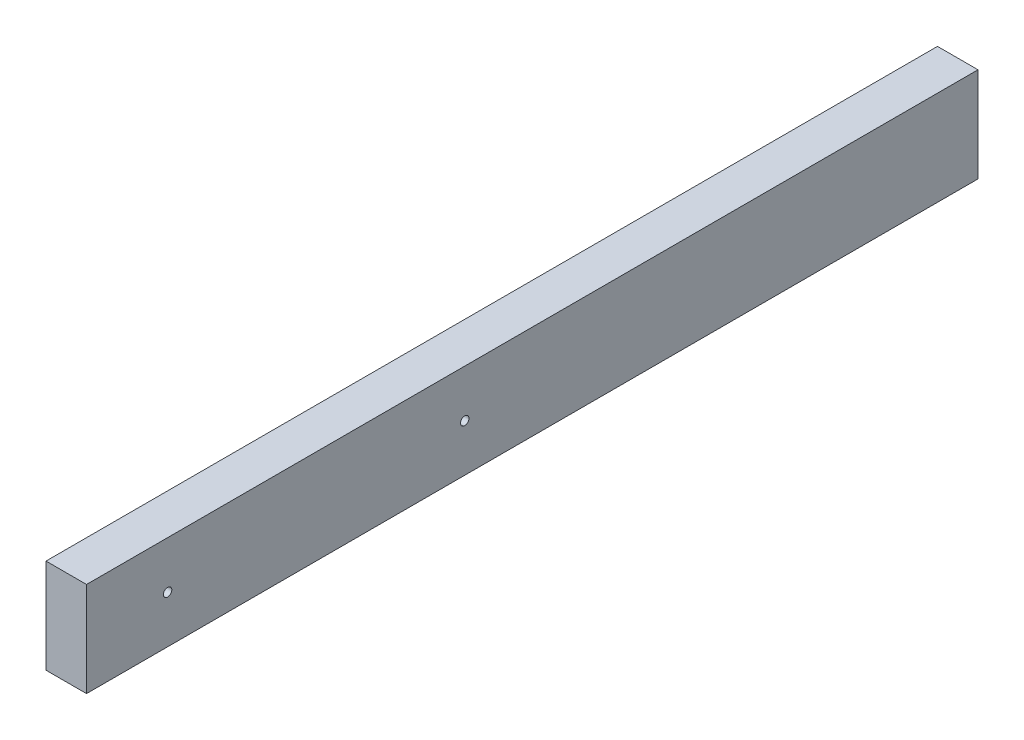
ISO-10303-21;
HEADER;
FILE_DESCRIPTION(('STEP AP214'),'2;1');
FILE_NAME('part.step','',(''),(''),'','','');
FILE_SCHEMA(('AUTOMOTIVE_DESIGN { 1 0 10303 214 1 1 1 1 }'));
ENDSEC;
DATA;
#1=APPLICATION_CONTEXT('core data for automotive mechanical design processes');
#2=APPLICATION_PROTOCOL_DEFINITION('international standard','automotive_design',2000,#1);
#3=PRODUCT_CONTEXT('',#1,'mechanical');
#4=PRODUCT('Part','Part','',(#3));
#5=PRODUCT_RELATED_PRODUCT_CATEGORY('part','',(#4));
#6=PRODUCT_DEFINITION_FORMATION('','',#4);
#7=PRODUCT_DEFINITION_CONTEXT('part definition',#1,'design');
#8=PRODUCT_DEFINITION('design','',#6,#7);
#9=PRODUCT_DEFINITION_SHAPE('','',#8);
#10=(LENGTH_UNIT() NAMED_UNIT(*) SI_UNIT(.MILLI.,.METRE.));
#11=(NAMED_UNIT(*) PLANE_ANGLE_UNIT() SI_UNIT($,.RADIAN.));
#12=(NAMED_UNIT(*) SI_UNIT($,.STERADIAN.) SOLID_ANGLE_UNIT());
#13=UNCERTAINTY_MEASURE_WITH_UNIT(LENGTH_MEASURE(1.E-05),#10,'distance_accuracy_value','');
#14=(GEOMETRIC_REPRESENTATION_CONTEXT(3) GLOBAL_UNCERTAINTY_ASSIGNED_CONTEXT((#13)) GLOBAL_UNIT_ASSIGNED_CONTEXT((#10,
#11,#12)) REPRESENTATION_CONTEXT('',''));
#15=CARTESIAN_POINT('',(0.,0.,0.));
#16=DIRECTION('',(0.,0.,1.));
#17=DIRECTION('',(1.,0.,0.));
#18=AXIS2_PLACEMENT_3D('',#15,#16,#17);
#19=CARTESIAN_POINT('',(19.05,-44.45,838.2));
#20=DIRECTION('',(-1.,0.,0.));
#21=DIRECTION('',(0.,0.,1.));
#22=AXIS2_PLACEMENT_3D('',#19,#20,#21);
#23=PLANE('',#22);
#24=CARTESIAN_POINT('',(19.05,0.,482.6));
#25=DIRECTION('',(1.,0.,0.));
#26=DIRECTION('',(0.,0.,-1.));
#27=AXIS2_PLACEMENT_3D('',#24,#25,#26);
#28=CIRCLE('',#27,3.96875);
#29=CARTESIAN_POINT('',(19.05,0.,478.63125));
#30=VERTEX_POINT('',#29);
#31=EDGE_CURVE('E139',#30,#30,#28,.T.);
#32=ORIENTED_EDGE('',*,*,#31,.F.);
#33=EDGE_LOOP('',(#32));
#34=FACE_BOUND('',#33,.T.);
#35=CARTESIAN_POINT('',(19.05,0.,762.));
#36=DIRECTION('',(1.,0.,0.));
#37=DIRECTION('',(0.,0.,-1.));
#38=AXIS2_PLACEMENT_3D('',#35,#36,#37);
#39=CIRCLE('',#38,3.96875);
#40=CARTESIAN_POINT('',(19.05,0.,758.03125));
#41=VERTEX_POINT('',#40);
#42=EDGE_CURVE('E131',#41,#41,#39,.T.);
#43=ORIENTED_EDGE('',*,*,#42,.F.);
#44=EDGE_LOOP('',(#43));
#45=FACE_BOUND('',#44,.T.);
#46=DIRECTION('',(0.,1.,0.));
#47=VECTOR('',#46,1.);
#48=CARTESIAN_POINT('',(19.05,-44.45,0.));
#49=LINE('',#48,#47);
#50=CARTESIAN_POINT('',(19.05,-44.45,0.));
#51=VERTEX_POINT('',#50);
#52=CARTESIAN_POINT('',(19.05,44.45,0.));
#53=VERTEX_POINT('',#52);
#54=EDGE_CURVE('E105',#51,#53,#49,.T.);
#55=ORIENTED_EDGE('',*,*,#54,.T.);
#56=DIRECTION('',(0.,0.,-1.));
#57=VECTOR('',#56,1.);
#58=CARTESIAN_POINT('',(19.05,44.45,838.2));
#59=LINE('',#58,#57);
#60=CARTESIAN_POINT('',(19.05,44.45,838.2));
#61=VERTEX_POINT('',#60);
#62=EDGE_CURVE('E11',#61,#53,#59,.T.);
#63=ORIENTED_EDGE('',*,*,#62,.F.);
#64=DIRECTION('',(0.,1.,0.));
#65=VECTOR('',#64,1.);
#66=CARTESIAN_POINT('',(19.05,-44.45,838.2));
#67=LINE('',#66,#65);
#68=CARTESIAN_POINT('',(19.05,-44.45,838.2));
#69=VERTEX_POINT('',#68);
#70=EDGE_CURVE('E88',#69,#61,#67,.T.);
#71=ORIENTED_EDGE('',*,*,#70,.F.);
#72=DIRECTION('',(0.,0.,-1.));
#73=VECTOR('',#72,1.);
#74=CARTESIAN_POINT('',(19.05,-44.45,838.2));
#75=LINE('',#74,#73);
#76=EDGE_CURVE('E101',#69,#51,#75,.T.);
#77=ORIENTED_EDGE('',*,*,#76,.T.);
#78=EDGE_LOOP('',(#55,#63,#71,#77));
#79=FACE_BOUND('',#78,.T.);
#80=ADVANCED_FACE('F36',(#34,#45,#79),#23,.F.);
#81=CARTESIAN_POINT('',(-19.05,44.45,838.2));
#82=DIRECTION('',(0.,-1.,0.));
#83=DIRECTION('',(0.,0.,-1.));
#84=AXIS2_PLACEMENT_3D('',#81,#82,#83);
#85=PLANE('',#84);
#86=DIRECTION('',(-1.,0.,0.));
#87=VECTOR('',#86,1.);
#88=CARTESIAN_POINT('',(-19.05,44.45,0.));
#89=LINE('',#88,#87);
#90=CARTESIAN_POINT('',(-19.05,44.45,0.));
#91=VERTEX_POINT('',#90);
#92=EDGE_CURVE('E93',#53,#91,#89,.T.);
#93=ORIENTED_EDGE('',*,*,#92,.T.);
#94=DIRECTION('',(0.,0.,-1.));
#95=VECTOR('',#94,1.);
#96=CARTESIAN_POINT('',(-19.05,44.45,838.2));
#97=LINE('',#96,#95);
#98=CARTESIAN_POINT('',(-19.05,44.45,838.2));
#99=VERTEX_POINT('',#98);
#100=EDGE_CURVE('E45',#99,#91,#97,.T.);
#101=ORIENTED_EDGE('',*,*,#100,.F.);
#102=DIRECTION('',(-1.,0.,0.));
#103=VECTOR('',#102,1.);
#104=CARTESIAN_POINT('',(-19.05,44.45,838.2));
#105=LINE('',#104,#103);
#106=EDGE_CURVE('E83',#61,#99,#105,.T.);
#107=ORIENTED_EDGE('',*,*,#106,.F.);
#108=ORIENTED_EDGE('',*,*,#62,.T.);
#109=EDGE_LOOP('',(#93,#101,#107,#108));
#110=FACE_BOUND('',#109,.T.);
#111=ADVANCED_FACE('F92',(#110),#85,.F.);
#112=CARTESIAN_POINT('',(-19.05,-44.45,838.2));
#113=DIRECTION('',(1.,0.,0.));
#114=DIRECTION('',(0.,0.,-1.));
#115=AXIS2_PLACEMENT_3D('',#112,#113,#114);
#116=PLANE('',#115);
#117=CARTESIAN_POINT('',(-19.05,0.,482.6));
#118=DIRECTION('',(1.,0.,0.));
#119=DIRECTION('',(0.,0.,-1.));
#120=AXIS2_PLACEMENT_3D('',#117,#118,#119);
#121=CIRCLE('',#120,3.96874999999999);
#122=CARTESIAN_POINT('',(-19.05,0.,478.63125));
#123=VERTEX_POINT('',#122);
#124=EDGE_CURVE('E135',#123,#123,#121,.T.);
#125=ORIENTED_EDGE('',*,*,#124,.T.);
#126=EDGE_LOOP('',(#125));
#127=FACE_BOUND('',#126,.T.);
#128=CARTESIAN_POINT('',(-19.05,0.,762.));
#129=DIRECTION('',(1.,0.,0.));
#130=DIRECTION('',(0.,0.,-1.));
#131=AXIS2_PLACEMENT_3D('',#128,#129,#130);
#132=CIRCLE('',#131,3.96874999999999);
#133=CARTESIAN_POINT('',(-19.05,0.,758.03125));
#134=VERTEX_POINT('',#133);
#135=EDGE_CURVE('E109',#134,#134,#132,.T.);
#136=ORIENTED_EDGE('',*,*,#135,.T.);
#137=EDGE_LOOP('',(#136));
#138=FACE_BOUND('',#137,.T.);
#139=DIRECTION('',(0.,-1.,0.));
#140=VECTOR('',#139,1.);
#141=CARTESIAN_POINT('',(-19.05,-44.45,0.));
#142=LINE('',#141,#140);
#143=CARTESIAN_POINT('',(-19.05,-44.45,0.));
#144=VERTEX_POINT('',#143);
#145=EDGE_CURVE('E70',#91,#144,#142,.T.);
#146=ORIENTED_EDGE('',*,*,#145,.T.);
#147=DIRECTION('',(0.,0.,-1.));
#148=VECTOR('',#147,1.);
#149=CARTESIAN_POINT('',(-19.05,-44.45,838.2));
#150=LINE('',#149,#148);
#151=CARTESIAN_POINT('',(-19.05,-44.45,838.2));
#152=VERTEX_POINT('',#151);
#153=EDGE_CURVE('E95',#152,#144,#150,.T.);
#154=ORIENTED_EDGE('',*,*,#153,.F.);
#155=DIRECTION('',(0.,-1.,0.));
#156=VECTOR('',#155,1.);
#157=CARTESIAN_POINT('',(-19.05,-44.45,838.2));
#158=LINE('',#157,#156);
#159=EDGE_CURVE('E86',#99,#152,#158,.T.);
#160=ORIENTED_EDGE('',*,*,#159,.F.);
#161=ORIENTED_EDGE('',*,*,#100,.T.);
#162=EDGE_LOOP('',(#146,#154,#160,#161));
#163=FACE_BOUND('',#162,.T.);
#164=ADVANCED_FACE('F96',(#127,#138,#163),#116,.F.);
#165=CARTESIAN_POINT('',(-19.05,-44.45,838.2));
#166=DIRECTION('',(0.,1.,0.));
#167=DIRECTION('',(0.,0.,1.));
#168=AXIS2_PLACEMENT_3D('',#165,#166,#167);
#169=PLANE('',#168);
#170=DIRECTION('',(1.,0.,0.));
#171=VECTOR('',#170,1.);
#172=CARTESIAN_POINT('',(-19.05,-44.45,0.));
#173=LINE('',#172,#171);
#174=EDGE_CURVE('E76',#144,#51,#173,.T.);
#175=ORIENTED_EDGE('',*,*,#174,.T.);
#176=ORIENTED_EDGE('',*,*,#76,.F.);
#177=DIRECTION('',(1.,0.,0.));
#178=VECTOR('',#177,1.);
#179=CARTESIAN_POINT('',(-19.05,-44.45,838.2));
#180=LINE('',#179,#178);
#181=EDGE_CURVE('E53',#152,#69,#180,.T.);
#182=ORIENTED_EDGE('',*,*,#181,.F.);
#183=ORIENTED_EDGE('',*,*,#153,.T.);
#184=EDGE_LOOP('',(#175,#176,#182,#183));
#185=FACE_BOUND('',#184,.T.);
#186=ADVANCED_FACE('F120',(#185),#169,.F.);
#187=CARTESIAN_POINT('',(0.,0.,838.2));
#188=DIRECTION('',(0.,0.,-1.));
#189=DIRECTION('',(-1.,0.,0.));
#190=AXIS2_PLACEMENT_3D('',#187,#188,#189);
#191=PLANE('',#190);
#192=ORIENTED_EDGE('',*,*,#70,.T.);
#193=ORIENTED_EDGE('',*,*,#106,.T.);
#194=ORIENTED_EDGE('',*,*,#159,.T.);
#195=ORIENTED_EDGE('',*,*,#181,.T.);
#196=EDGE_LOOP('',(#192,#193,#194,#195));
#197=FACE_BOUND('',#196,.T.);
#198=ADVANCED_FACE('F84',(#197),#191,.F.);
#199=CARTESIAN_POINT('',(0.,0.,0.));
#200=DIRECTION('',(0.,0.,-1.));
#201=DIRECTION('',(-1.,0.,0.));
#202=AXIS2_PLACEMENT_3D('',#199,#200,#201);
#203=PLANE('',#202);
#204=ORIENTED_EDGE('',*,*,#54,.F.);
#205=ORIENTED_EDGE('',*,*,#174,.F.);
#206=ORIENTED_EDGE('',*,*,#145,.F.);
#207=ORIENTED_EDGE('',*,*,#92,.F.);
#208=EDGE_LOOP('',(#204,#205,#206,#207));
#209=FACE_BOUND('',#208,.T.);
#210=ADVANCED_FACE('F123',(#209),#203,.T.);
#211=CARTESIAN_POINT('',(19.05,0.,762.));
#212=DIRECTION('',(1.,0.,0.));
#213=DIRECTION('',(0.,0.,-1.));
#214=AXIS2_PLACEMENT_3D('',#211,#212,#213);
#215=CYLINDRICAL_SURFACE('',#214,3.96874999999999);
#216=ORIENTED_EDGE('',*,*,#135,.F.);
#217=EDGE_LOOP('',(#216));
#218=FACE_BOUND('',#217,.T.);
#219=ORIENTED_EDGE('',*,*,#42,.T.);
#220=EDGE_LOOP('',(#219));
#221=FACE_BOUND('',#220,.T.);
#222=ADVANCED_FACE('F151',(#218,#221),#215,.F.);
#223=CARTESIAN_POINT('',(19.05,0.,482.6));
#224=DIRECTION('',(1.,0.,0.));
#225=DIRECTION('',(0.,0.,-1.));
#226=AXIS2_PLACEMENT_3D('',#223,#224,#225);
#227=CYLINDRICAL_SURFACE('',#226,3.96874999999999);
#228=ORIENTED_EDGE('',*,*,#124,.F.);
#229=EDGE_LOOP('',(#228));
#230=FACE_BOUND('',#229,.T.);
#231=ORIENTED_EDGE('',*,*,#31,.T.);
#232=EDGE_LOOP('',(#231));
#233=FACE_BOUND('',#232,.T.);
#234=ADVANCED_FACE('F145',(#230,#233),#227,.F.);
#235=CLOSED_SHELL('',(#80,#111,#164,#186,#198,#210,#222,#234));
#236=MANIFOLD_SOLID_BREP('B2',#235);
#237=ADVANCED_BREP_SHAPE_REPRESENTATION('',(#18,#236),#14);
#238=SHAPE_DEFINITION_REPRESENTATION(#9,#237);
ENDSEC;
END-ISO-10303-21;
